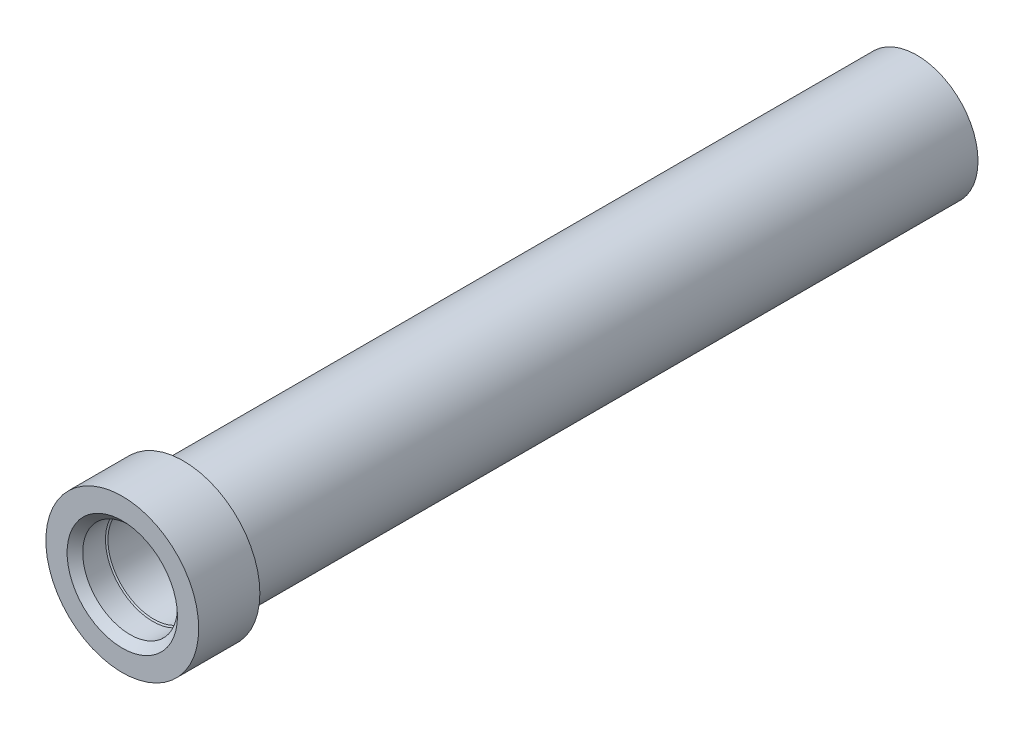
ISO-10303-21;
HEADER;
FILE_DESCRIPTION(('STEP AP214'),'2;1');
FILE_NAME('part.step','',(''),(''),'','','');
FILE_SCHEMA(('AUTOMOTIVE_DESIGN { 1 0 10303 214 1 1 1 1 }'));
ENDSEC;
DATA;
#1=APPLICATION_CONTEXT('core data for automotive mechanical design processes');
#2=APPLICATION_PROTOCOL_DEFINITION('international standard','automotive_design',2000,#1);
#3=PRODUCT_CONTEXT('',#1,'mechanical');
#4=PRODUCT('Part','Part','',(#3));
#5=PRODUCT_RELATED_PRODUCT_CATEGORY('part','',(#4));
#6=PRODUCT_DEFINITION_FORMATION('','',#4);
#7=PRODUCT_DEFINITION_CONTEXT('part definition',#1,'design');
#8=PRODUCT_DEFINITION('design','',#6,#7);
#9=PRODUCT_DEFINITION_SHAPE('','',#8);
#10=(LENGTH_UNIT() NAMED_UNIT(*) SI_UNIT(.MILLI.,.METRE.));
#11=(NAMED_UNIT(*) PLANE_ANGLE_UNIT() SI_UNIT($,.RADIAN.));
#12=(NAMED_UNIT(*) SI_UNIT($,.STERADIAN.) SOLID_ANGLE_UNIT());
#13=UNCERTAINTY_MEASURE_WITH_UNIT(LENGTH_MEASURE(1.E-05),#10,'distance_accuracy_value','');
#14=(GEOMETRIC_REPRESENTATION_CONTEXT(3) GLOBAL_UNCERTAINTY_ASSIGNED_CONTEXT((#13)) GLOBAL_UNIT_ASSIGNED_CONTEXT((#10,
#11,#12)) REPRESENTATION_CONTEXT('',''));
#15=CARTESIAN_POINT('',(0.,0.,0.));
#16=DIRECTION('',(0.,0.,1.));
#17=DIRECTION('',(1.,0.,0.));
#18=AXIS2_PLACEMENT_3D('',#15,#16,#17);
#19=CARTESIAN_POINT('',(0.,0.,4.14213562373095));
#20=DIRECTION('',(0.,0.,-1.));
#21=DIRECTION('',(-1.,0.,0.));
#22=AXIS2_PLACEMENT_3D('',#19,#20,#21);
#23=CYLINDRICAL_SURFACE('',#22,5.);
#24=CARTESIAN_POINT('',(0.,0.,-129.95));
#25=DIRECTION('',(0.,0.,-1.));
#26=DIRECTION('',(-1.,0.,0.));
#27=AXIS2_PLACEMENT_3D('',#24,#25,#26);
#28=CIRCLE('',#27,5.);
#29=CARTESIAN_POINT('',(-5.,0.,-129.95));
#30=VERTEX_POINT('',#29);
#31=EDGE_CURVE('E52',#30,#30,#28,.T.);
#32=ORIENTED_EDGE('',*,*,#31,.T.);
#33=EDGE_LOOP('',(#32));
#34=FACE_BOUND('',#33,.T.);
#35=CARTESIAN_POINT('',(0.,0.,-80.));
#36=DIRECTION('',(0.,0.,1.));
#37=DIRECTION('',(1.,0.,0.));
#38=AXIS2_PLACEMENT_3D('',#35,#36,#37);
#39=CIRCLE('',#38,5.);
#40=CARTESIAN_POINT('',(5.,0.,-80.));
#41=VERTEX_POINT('',#40);
#42=EDGE_CURVE('E50',#41,#41,#39,.F.);
#43=ORIENTED_EDGE('',*,*,#42,.F.);
#44=EDGE_LOOP('',(#43));
#45=FACE_BOUND('',#44,.T.);
#46=ADVANCED_FACE('F34',(#34,#45),#23,.F.);
#47=CARTESIAN_POINT('',(0.,12.5,0.));
#48=DIRECTION('',(0.,0.,-1.));
#49=DIRECTION('',(-1.,0.,0.));
#50=AXIS2_PLACEMENT_3D('',#47,#48,#49);
#51=PLANE('',#50);
#52=CARTESIAN_POINT('',(0.,0.,0.));
#53=DIRECTION('',(0.,0.,1.));
#54=DIRECTION('',(1.,0.,0.));
#55=AXIS2_PLACEMENT_3D('',#52,#53,#54);
#56=CIRCLE('',#55,9.025);
#57=CARTESIAN_POINT('',(9.025,0.,0.));
#58=VERTEX_POINT('',#57);
#59=EDGE_CURVE('E123',#58,#58,#56,.T.);
#60=ORIENTED_EDGE('',*,*,#59,.F.);
#61=EDGE_LOOP('',(#60));
#62=FACE_BOUND('',#61,.T.);
#63=CARTESIAN_POINT('',(0.,0.,0.));
#64=DIRECTION('',(0.,0.,1.));
#65=DIRECTION('',(1.,0.,0.));
#66=AXIS2_PLACEMENT_3D('',#63,#64,#65);
#67=CIRCLE('',#66,12.5);
#68=CARTESIAN_POINT('',(12.5,0.,0.));
#69=VERTEX_POINT('',#68);
#70=EDGE_CURVE('E10',#69,#69,#67,.T.);
#71=ORIENTED_EDGE('',*,*,#70,.T.);
#72=EDGE_LOOP('',(#71));
#73=FACE_BOUND('',#72,.T.);
#74=ADVANCED_FACE('F36',(#62,#73),#51,.F.);
#75=CARTESIAN_POINT('',(0.,0.,0.));
#76=DIRECTION('',(0.,0.,1.));
#77=DIRECTION('',(1.,0.,0.));
#78=AXIS2_PLACEMENT_3D('',#75,#76,#77);
#79=CYLINDRICAL_SURFACE('',#78,12.5);
#80=ORIENTED_EDGE('',*,*,#70,.F.);
#81=EDGE_LOOP('',(#80));
#82=FACE_BOUND('',#81,.T.);
#83=CARTESIAN_POINT('',(0.,0.,-10.));
#84=DIRECTION('',(0.,0.,1.));
#85=DIRECTION('',(1.,0.,0.));
#86=AXIS2_PLACEMENT_3D('',#83,#84,#85);
#87=CIRCLE('',#86,12.5);
#88=CARTESIAN_POINT('',(12.5,0.,-10.));
#89=VERTEX_POINT('',#88);
#90=EDGE_CURVE('E42',#89,#89,#87,.T.);
#91=ORIENTED_EDGE('',*,*,#90,.T.);
#92=EDGE_LOOP('',(#91));
#93=FACE_BOUND('',#92,.T.);
#94=ADVANCED_FACE('F97',(#82,#93),#79,.T.);
#95=CARTESIAN_POINT('',(0.,12.5,-10.));
#96=DIRECTION('',(0.,0.,1.));
#97=DIRECTION('',(1.,0.,0.));
#98=AXIS2_PLACEMENT_3D('',#95,#96,#97);
#99=PLANE('',#98);
#100=ORIENTED_EDGE('',*,*,#90,.F.);
#101=EDGE_LOOP('',(#100));
#102=FACE_BOUND('',#101,.T.);
#103=CARTESIAN_POINT('',(0.,0.,-10.));
#104=DIRECTION('',(0.,0.,1.));
#105=DIRECTION('',(1.,0.,0.));
#106=AXIS2_PLACEMENT_3D('',#103,#104,#105);
#107=CIRCLE('',#106,10.);
#108=CARTESIAN_POINT('',(10.,0.,-10.));
#109=VERTEX_POINT('',#108);
#110=EDGE_CURVE('E47',#109,#109,#107,.T.);
#111=ORIENTED_EDGE('',*,*,#110,.T.);
#112=EDGE_LOOP('',(#111));
#113=FACE_BOUND('',#112,.T.);
#114=ADVANCED_FACE('F72',(#102,#113),#99,.F.);
#115=CARTESIAN_POINT('',(0.,0.,0.));
#116=DIRECTION('',(0.,0.,1.));
#117=DIRECTION('',(1.,0.,0.));
#118=AXIS2_PLACEMENT_3D('',#115,#116,#117);
#119=CYLINDRICAL_SURFACE('',#118,10.);
#120=ORIENTED_EDGE('',*,*,#110,.F.);
#121=EDGE_LOOP('',(#120));
#122=FACE_BOUND('',#121,.T.);
#123=CARTESIAN_POINT('',(0.,0.,-129.95));
#124=DIRECTION('',(0.,0.,1.));
#125=DIRECTION('',(1.,0.,0.));
#126=AXIS2_PLACEMENT_3D('',#123,#124,#125);
#127=CIRCLE('',#126,10.);
#128=CARTESIAN_POINT('',(10.,0.,-129.95));
#129=VERTEX_POINT('',#128);
#130=EDGE_CURVE('E57',#129,#129,#127,.T.);
#131=ORIENTED_EDGE('',*,*,#130,.T.);
#132=EDGE_LOOP('',(#131));
#133=FACE_BOUND('',#132,.T.);
#134=ADVANCED_FACE('F74',(#122,#133),#119,.T.);
#135=CARTESIAN_POINT('',(0.,10.,-129.95));
#136=DIRECTION('',(0.,0.,1.));
#137=DIRECTION('',(1.,0.,0.));
#138=AXIS2_PLACEMENT_3D('',#135,#136,#137);
#139=PLANE('',#138);
#140=ORIENTED_EDGE('',*,*,#31,.F.);
#141=EDGE_LOOP('',(#140));
#142=FACE_BOUND('',#141,.T.);
#143=ORIENTED_EDGE('',*,*,#130,.F.);
#144=EDGE_LOOP('',(#143));
#145=FACE_BOUND('',#144,.T.);
#146=ADVANCED_FACE('F77',(#142,#145),#139,.F.);
#147=CARTESIAN_POINT('',(0.,0.,-80.));
#148=DIRECTION('',(0.,0.,1.));
#149=DIRECTION('',(1.,0.,0.));
#150=AXIS2_PLACEMENT_3D('',#147,#148,#149);
#151=PLANE('',#150);
#152=CARTESIAN_POINT('',(0.,0.,-80.));
#153=DIRECTION('',(0.,0.,1.));
#154=DIRECTION('',(1.,0.,0.));
#155=AXIS2_PLACEMENT_3D('',#152,#153,#154);
#156=CIRCLE('',#155,7.5);
#157=CARTESIAN_POINT('',(7.5,0.,-80.));
#158=VERTEX_POINT('',#157);
#159=EDGE_CURVE('E53',#158,#158,#156,.T.);
#160=ORIENTED_EDGE('',*,*,#159,.T.);
#161=EDGE_LOOP('',(#160));
#162=FACE_BOUND('',#161,.T.);
#163=ORIENTED_EDGE('',*,*,#42,.T.);
#164=EDGE_LOOP('',(#163));
#165=FACE_BOUND('',#164,.T.);
#166=ADVANCED_FACE('F82',(#162,#165),#151,.T.);
#167=CARTESIAN_POINT('',(0.,0.,-80.));
#168=DIRECTION('',(0.,0.,1.));
#169=DIRECTION('',(1.,0.,0.));
#170=AXIS2_PLACEMENT_3D('',#167,#168,#169);
#171=CYLINDRICAL_SURFACE('',#170,7.5);
#172=CARTESIAN_POINT('',(0.,0.,-5.15021515475688));
#173=DIRECTION('',(0.,0.,1.));
#174=DIRECTION('',(1.,0.,0.));
#175=AXIS2_PLACEMENT_3D('',#172,#173,#174);
#176=CIRCLE('',#175,7.5);
#177=CARTESIAN_POINT('',(7.5,0.,-5.15021515475688));
#178=VERTEX_POINT('',#177);
#179=EDGE_CURVE('E38',#178,#178,#176,.T.);
#180=ORIENTED_EDGE('',*,*,#179,.T.);
#181=EDGE_LOOP('',(#180));
#182=FACE_BOUND('',#181,.T.);
#183=ORIENTED_EDGE('',*,*,#159,.F.);
#184=EDGE_LOOP('',(#183));
#185=FACE_BOUND('',#184,.T.);
#186=ADVANCED_FACE('F88',(#182,#185),#171,.F.);
#187=CARTESIAN_POINT('',(0.,0.,-5.));
#188=DIRECTION('',(0.,0.,1.));
#189=DIRECTION('',(1.,0.,0.));
#190=AXIS2_PLACEMENT_3D('',#187,#188,#189);
#191=CONICAL_SURFACE('',#190,7.74999999999999,1.02974425867665);
#192=CARTESIAN_POINT('',(0.,0.,-5.));
#193=DIRECTION('',(0.,0.,1.));
#194=DIRECTION('',(1.,0.,0.));
#195=AXIS2_PLACEMENT_3D('',#192,#193,#194);
#196=CIRCLE('',#195,7.74999999999999);
#197=CARTESIAN_POINT('',(7.74999999999999,0.,-5.));
#198=VERTEX_POINT('',#197);
#199=EDGE_CURVE('E64',#198,#198,#196,.T.);
#200=ORIENTED_EDGE('',*,*,#199,.T.);
#201=EDGE_LOOP('',(#200));
#202=FACE_BOUND('',#201,.T.);
#203=ORIENTED_EDGE('',*,*,#179,.F.);
#204=EDGE_LOOP('',(#203));
#205=FACE_BOUND('',#204,.T.);
#206=ADVANCED_FACE('F102',(#202,#205),#191,.F.);
#207=CARTESIAN_POINT('',(0.,0.,0.));
#208=DIRECTION('',(0.,0.,1.));
#209=DIRECTION('',(1.,0.,0.));
#210=AXIS2_PLACEMENT_3D('',#207,#208,#209);
#211=CYLINDRICAL_SURFACE('',#210,7.74999999999999);
#212=ORIENTED_EDGE('',*,*,#199,.F.);
#213=EDGE_LOOP('',(#212));
#214=FACE_BOUND('',#213,.T.);
#215=CARTESIAN_POINT('',(0.,0.,-1.275));
#216=DIRECTION('',(0.,0.,1.));
#217=DIRECTION('',(1.,0.,0.));
#218=AXIS2_PLACEMENT_3D('',#215,#216,#217);
#219=CIRCLE('',#218,7.74999999999999);
#220=CARTESIAN_POINT('',(7.74999999999999,0.,-1.275));
#221=VERTEX_POINT('',#220);
#222=EDGE_CURVE('E120',#221,#221,#219,.T.);
#223=ORIENTED_EDGE('',*,*,#222,.T.);
#224=EDGE_LOOP('',(#223));
#225=FACE_BOUND('',#224,.T.);
#226=ADVANCED_FACE('F107',(#214,#225),#211,.F.);
#227=CARTESIAN_POINT('',(0.,0.,0.));
#228=DIRECTION('',(0.,0.,1.));
#229=DIRECTION('',(1.,0.,0.));
#230=AXIS2_PLACEMENT_3D('',#227,#228,#229);
#231=CONICAL_SURFACE('',#230,9.025,0.785398163397451);
#232=ORIENTED_EDGE('',*,*,#222,.F.);
#233=EDGE_LOOP('',(#232));
#234=FACE_BOUND('',#233,.T.);
#235=ORIENTED_EDGE('',*,*,#59,.T.);
#236=EDGE_LOOP('',(#235));
#237=FACE_BOUND('',#236,.T.);
#238=ADVANCED_FACE('F111',(#234,#237),#231,.F.);
#239=CLOSED_SHELL('',(#46,#74,#94,#114,#134,#146,#166,#186,#206,#226,#238));
#240=MANIFOLD_SOLID_BREP('B2',#239);
#241=ADVANCED_BREP_SHAPE_REPRESENTATION('',(#18,#240),#14);
#242=SHAPE_DEFINITION_REPRESENTATION(#9,#241);
ENDSEC;
END-ISO-10303-21;
